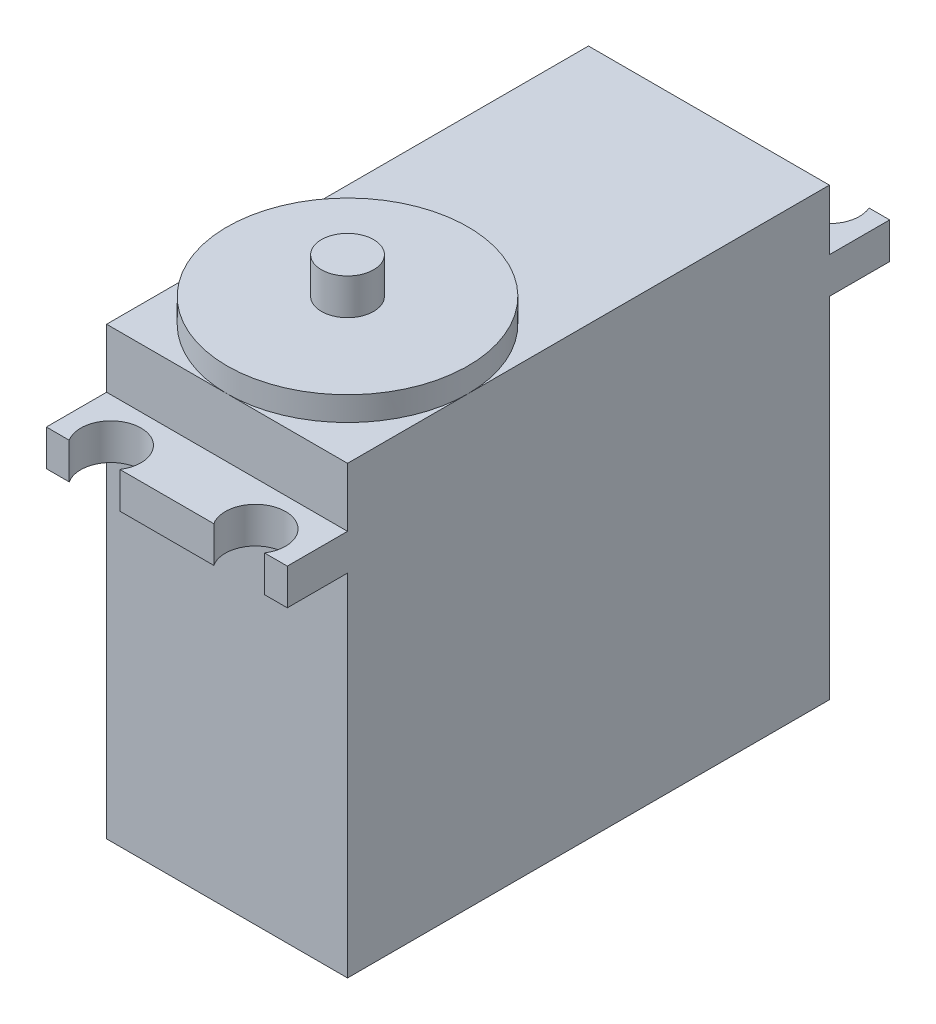
ISO-10303-21;
HEADER;
FILE_DESCRIPTION(('STEP AP214'),'2;1');
FILE_NAME('part.step','',(''),(''),'','','');
FILE_SCHEMA(('AUTOMOTIVE_DESIGN { 1 0 10303 214 1 1 1 1 }'));
ENDSEC;
DATA;
#1=APPLICATION_CONTEXT('core data for automotive mechanical design processes');
#2=APPLICATION_PROTOCOL_DEFINITION('international standard','automotive_design',2000,#1);
#3=PRODUCT_CONTEXT('',#1,'mechanical');
#4=PRODUCT('Part','Part','',(#3));
#5=PRODUCT_RELATED_PRODUCT_CATEGORY('part','',(#4));
#6=PRODUCT_DEFINITION_FORMATION('','',#4);
#7=PRODUCT_DEFINITION_CONTEXT('part definition',#1,'design');
#8=PRODUCT_DEFINITION('design','',#6,#7);
#9=PRODUCT_DEFINITION_SHAPE('','',#8);
#10=(LENGTH_UNIT() NAMED_UNIT(*) SI_UNIT(.MILLI.,.METRE.));
#11=(NAMED_UNIT(*) PLANE_ANGLE_UNIT() SI_UNIT($,.RADIAN.));
#12=(NAMED_UNIT(*) SI_UNIT($,.STERADIAN.) SOLID_ANGLE_UNIT());
#13=UNCERTAINTY_MEASURE_WITH_UNIT(LENGTH_MEASURE(1.E-05),#10,'distance_accuracy_value','');
#14=(GEOMETRIC_REPRESENTATION_CONTEXT(3) GLOBAL_UNCERTAINTY_ASSIGNED_CONTEXT((#13)) GLOBAL_UNIT_ASSIGNED_CONTEXT((#10,
#11,#12)) REPRESENTATION_CONTEXT('',''));
#15=CARTESIAN_POINT('',(0.,0.,0.));
#16=DIRECTION('',(0.,0.,1.));
#17=DIRECTION('',(1.,0.,0.));
#18=AXIS2_PLACEMENT_3D('',#15,#16,#17);
#19=CARTESIAN_POINT('',(0.,0.,-25.));
#20=DIRECTION('',(0.,0.,-1.));
#21=DIRECTION('',(-1.,0.,0.));
#22=AXIS2_PLACEMENT_3D('',#19,#20,#21);
#23=PLANE('',#22);
#24=DIRECTION('',(0.,1.,0.));
#25=VECTOR('',#24,1.);
#26=CARTESIAN_POINT('',(-8.29128784747792,29.,-25.));
#27=LINE('',#26,#25);
#28=CARTESIAN_POINT('',(-8.29128784747792,29.,-25.));
#29=VERTEX_POINT('',#28);
#30=CARTESIAN_POINT('',(-8.29128784747792,32.,-25.));
#31=VERTEX_POINT('',#30);
#32=EDGE_CURVE('E11',#29,#31,#27,.T.);
#33=ORIENTED_EDGE('',*,*,#32,.F.);
#34=DIRECTION('',(-1.,0.,0.));
#35=VECTOR('',#34,1.);
#36=CARTESIAN_POINT('',(10.,29.,-25.));
#37=LINE('',#36,#35);
#38=CARTESIAN_POINT('',(-10.,29.,-25.));
#39=VERTEX_POINT('',#38);
#40=EDGE_CURVE('E417',#29,#39,#37,.T.);
#41=ORIENTED_EDGE('',*,*,#40,.T.);
#42=DIRECTION('',(0.,1.,0.));
#43=VECTOR('',#42,1.);
#44=CARTESIAN_POINT('',(-10.,32.,-25.));
#45=LINE('',#44,#43);
#46=CARTESIAN_POINT('',(-10.,32.,-25.));
#47=VERTEX_POINT('',#46);
#48=EDGE_CURVE('E211',#39,#47,#45,.T.);
#49=ORIENTED_EDGE('',*,*,#48,.T.);
#50=DIRECTION('',(1.,0.,0.));
#51=VECTOR('',#50,1.);
#52=CARTESIAN_POINT('',(10.,32.,-25.));
#53=LINE('',#52,#51);
#54=EDGE_CURVE('E205',#47,#31,#53,.T.);
#55=ORIENTED_EDGE('',*,*,#54,.T.);
#56=EDGE_LOOP('',(#33,#41,#49,#55));
#57=FACE_BOUND('',#56,.T.);
#58=ADVANCED_FACE('F39',(#57),#23,.T.);
#59=DIRECTION('',(0.,1.,0.));
#60=VECTOR('',#59,1.);
#61=CARTESIAN_POINT('',(-3.70871215252208,29.,-25.));
#62=LINE('',#61,#60);
#63=CARTESIAN_POINT('',(-3.70871215252208,32.,-25.));
#64=VERTEX_POINT('',#63);
#65=CARTESIAN_POINT('',(-3.70871215252208,29.,-25.));
#66=VERTEX_POINT('',#65);
#67=EDGE_CURVE('E48',#64,#66,#62,.F.);
#68=ORIENTED_EDGE('',*,*,#67,.F.);
#69=CARTESIAN_POINT('',(3.70871215252208,32.,-25.));
#70=VERTEX_POINT('',#69);
#71=EDGE_CURVE('E198',#64,#70,#53,.T.);
#72=ORIENTED_EDGE('',*,*,#71,.T.);
#73=DIRECTION('',(0.,1.,0.));
#74=VECTOR('',#73,1.);
#75=CARTESIAN_POINT('',(3.70871215252208,29.,-25.));
#76=LINE('',#75,#74);
#77=CARTESIAN_POINT('',(3.70871215252208,29.,-25.));
#78=VERTEX_POINT('',#77);
#79=EDGE_CURVE('E183',#78,#70,#76,.T.);
#80=ORIENTED_EDGE('',*,*,#79,.F.);
#81=EDGE_CURVE('E415',#78,#66,#37,.T.);
#82=ORIENTED_EDGE('',*,*,#81,.T.);
#83=EDGE_LOOP('',(#68,#72,#80,#82));
#84=FACE_BOUND('',#83,.T.);
#85=ADVANCED_FACE('F203',(#84),#23,.T.);
#86=CARTESIAN_POINT('',(-10.,37.,-20.));
#87=DIRECTION('',(0.,0.,1.));
#88=DIRECTION('',(1.,0.,0.));
#89=AXIS2_PLACEMENT_3D('',#86,#87,#88);
#90=PLANE('',#89);
#91=DIRECTION('',(1.,0.,0.));
#92=VECTOR('',#91,1.);
#93=CARTESIAN_POINT('',(10.,32.,-20.));
#94=LINE('',#93,#92);
#95=CARTESIAN_POINT('',(-10.,32.,-20.));
#96=VERTEX_POINT('',#95);
#97=CARTESIAN_POINT('',(10.,32.,-20.));
#98=VERTEX_POINT('',#97);
#99=EDGE_CURVE('E219',#96,#98,#94,.T.);
#100=ORIENTED_EDGE('',*,*,#99,.F.);
#101=DIRECTION('',(0.,-1.,0.));
#102=VECTOR('',#101,1.);
#103=CARTESIAN_POINT('',(-10.,37.,-20.));
#104=LINE('',#103,#102);
#105=CARTESIAN_POINT('',(-10.,37.,-20.));
#106=VERTEX_POINT('',#105);
#107=EDGE_CURVE('E378',#106,#96,#104,.T.);
#108=ORIENTED_EDGE('',*,*,#107,.F.);
#109=DIRECTION('',(-1.,0.,0.));
#110=VECTOR('',#109,1.);
#111=CARTESIAN_POINT('',(-10.,37.,-20.));
#112=LINE('',#111,#110);
#113=CARTESIAN_POINT('',(10.,37.,-20.));
#114=VERTEX_POINT('',#113);
#115=EDGE_CURVE('E359',#114,#106,#112,.T.);
#116=ORIENTED_EDGE('',*,*,#115,.F.);
#117=DIRECTION('',(0.,-1.,0.));
#118=VECTOR('',#117,1.);
#119=CARTESIAN_POINT('',(10.,37.,-20.));
#120=LINE('',#119,#118);
#121=EDGE_CURVE('E383',#114,#98,#120,.T.);
#122=ORIENTED_EDGE('',*,*,#121,.T.);
#123=EDGE_LOOP('',(#100,#108,#116,#122));
#124=FACE_BOUND('',#123,.T.);
#125=ADVANCED_FACE('F452',(#124),#90,.F.);
#126=DIRECTION('',(-1.,0.,0.));
#127=VECTOR('',#126,1.);
#128=CARTESIAN_POINT('',(10.,29.,-20.));
#129=LINE('',#128,#127);
#130=CARTESIAN_POINT('',(10.,29.,-20.));
#131=VERTEX_POINT('',#130);
#132=CARTESIAN_POINT('',(-10.,29.,-20.));
#133=VERTEX_POINT('',#132);
#134=EDGE_CURVE('E215',#131,#133,#129,.T.);
#135=ORIENTED_EDGE('',*,*,#134,.F.);
#136=CARTESIAN_POINT('',(10.,0.,-20.));
#137=VERTEX_POINT('',#136);
#138=EDGE_CURVE('E382',#131,#137,#120,.T.);
#139=ORIENTED_EDGE('',*,*,#138,.T.);
#140=DIRECTION('',(-1.,0.,0.));
#141=VECTOR('',#140,1.);
#142=CARTESIAN_POINT('',(-10.,0.,-20.));
#143=LINE('',#142,#141);
#144=CARTESIAN_POINT('',(-10.,0.,-20.));
#145=VERTEX_POINT('',#144);
#146=EDGE_CURVE('E374',#137,#145,#143,.T.);
#147=ORIENTED_EDGE('',*,*,#146,.T.);
#148=EDGE_CURVE('E362',#133,#145,#104,.T.);
#149=ORIENTED_EDGE('',*,*,#148,.F.);
#150=EDGE_LOOP('',(#135,#139,#147,#149));
#151=FACE_BOUND('',#150,.T.);
#152=ADVANCED_FACE('F509',(#151),#90,.F.);
#153=CARTESIAN_POINT('',(0.,0.,25.));
#154=DIRECTION('',(0.,0.,1.));
#155=DIRECTION('',(1.,0.,0.));
#156=AXIS2_PLACEMENT_3D('',#153,#154,#155);
#157=PLANE('',#156);
#158=DIRECTION('',(0.,1.,0.));
#159=VECTOR('',#158,1.);
#160=CARTESIAN_POINT('',(-3.89960686421983,29.1103546903995,25.));
#161=LINE('',#160,#159);
#162=CARTESIAN_POINT('',(-3.89960686421983,29.1103546903995,25.));
#163=VERTEX_POINT('',#162);
#164=CARTESIAN_POINT('',(-3.89960686421983,32.1103546903995,25.));
#165=VERTEX_POINT('',#164);
#166=EDGE_CURVE('E404',#163,#165,#161,.T.);
#167=ORIENTED_EDGE('',*,*,#166,.F.);
#168=DIRECTION('',(1.,0.,0.));
#169=VECTOR('',#168,1.);
#170=CARTESIAN_POINT('',(-10.,29.1103546903995,25.));
#171=LINE('',#170,#169);
#172=CARTESIAN_POINT('',(3.89960686421983,29.1103546903995,25.));
#173=VERTEX_POINT('',#172);
#174=EDGE_CURVE('E266',#163,#173,#171,.T.);
#175=ORIENTED_EDGE('',*,*,#174,.T.);
#176=DIRECTION('',(0.,1.,0.));
#177=VECTOR('',#176,1.);
#178=CARTESIAN_POINT('',(3.89960686421983,29.1103546903995,25.));
#179=LINE('',#178,#177);
#180=CARTESIAN_POINT('',(3.89960686421983,32.1103546903995,25.));
#181=VERTEX_POINT('',#180);
#182=EDGE_CURVE('E302',#181,#173,#179,.F.);
#183=ORIENTED_EDGE('',*,*,#182,.F.);
#184=DIRECTION('',(-1.,0.,0.));
#185=VECTOR('',#184,1.);
#186=CARTESIAN_POINT('',(-10.,32.1103546903995,25.));
#187=LINE('',#186,#185);
#188=EDGE_CURVE('E275',#181,#165,#187,.T.);
#189=ORIENTED_EDGE('',*,*,#188,.T.);
#190=EDGE_LOOP('',(#167,#175,#183,#189));
#191=FACE_BOUND('',#190,.T.);
#192=ADVANCED_FACE('F492',(#191),#157,.T.);
#193=DIRECTION('',(0.,1.,0.));
#194=VECTOR('',#193,1.);
#195=CARTESIAN_POINT('',(8.10039313578017,29.1103546903995,25.));
#196=LINE('',#195,#194);
#197=CARTESIAN_POINT('',(8.10039313578017,29.1103546903995,25.));
#198=VERTEX_POINT('',#197);
#199=CARTESIAN_POINT('',(8.10039313578017,32.1103546903995,25.));
#200=VERTEX_POINT('',#199);
#201=EDGE_CURVE('E398',#198,#200,#196,.T.);
#202=ORIENTED_EDGE('',*,*,#201,.F.);
#203=CARTESIAN_POINT('',(10.,29.1103546903995,25.));
#204=VERTEX_POINT('',#203);
#205=EDGE_CURVE('E259',#198,#204,#171,.T.);
#206=ORIENTED_EDGE('',*,*,#205,.T.);
#207=DIRECTION('',(0.,1.,0.));
#208=VECTOR('',#207,1.);
#209=CARTESIAN_POINT('',(10.,32.1103546903995,25.));
#210=LINE('',#209,#208);
#211=CARTESIAN_POINT('',(10.,32.1103546903995,25.));
#212=VERTEX_POINT('',#211);
#213=EDGE_CURVE('E265',#204,#212,#210,.T.);
#214=ORIENTED_EDGE('',*,*,#213,.T.);
#215=EDGE_CURVE('E270',#212,#200,#187,.T.);
#216=ORIENTED_EDGE('',*,*,#215,.T.);
#217=EDGE_LOOP('',(#202,#206,#214,#216));
#218=FACE_BOUND('',#217,.T.);
#219=ADVANCED_FACE('F470',(#218),#157,.T.);
#220=CARTESIAN_POINT('',(-10.,37.,20.));
#221=DIRECTION('',(0.,0.,-1.));
#222=DIRECTION('',(-1.,0.,0.));
#223=AXIS2_PLACEMENT_3D('',#220,#221,#222);
#224=PLANE('',#223);
#225=DIRECTION('',(1.,0.,0.));
#226=VECTOR('',#225,1.);
#227=CARTESIAN_POINT('',(-10.,29.1103546903995,20.));
#228=LINE('',#227,#226);
#229=CARTESIAN_POINT('',(-10.,29.1103546903995,20.));
#230=VERTEX_POINT('',#229);
#231=CARTESIAN_POINT('',(10.,29.1103546903995,20.));
#232=VERTEX_POINT('',#231);
#233=EDGE_CURVE('E245',#230,#232,#228,.T.);
#234=ORIENTED_EDGE('',*,*,#233,.F.);
#235=DIRECTION('',(0.,-1.,0.));
#236=VECTOR('',#235,1.);
#237=CARTESIAN_POINT('',(-10.,37.,20.));
#238=LINE('',#237,#236);
#239=CARTESIAN_POINT('',(-10.,0.,20.));
#240=VERTEX_POINT('',#239);
#241=EDGE_CURVE('E391',#230,#240,#238,.T.);
#242=ORIENTED_EDGE('',*,*,#241,.T.);
#243=DIRECTION('',(1.,0.,0.));
#244=VECTOR('',#243,1.);
#245=CARTESIAN_POINT('',(-10.,0.,20.));
#246=LINE('',#245,#244);
#247=CARTESIAN_POINT('',(10.,0.,20.));
#248=VERTEX_POINT('',#247);
#249=EDGE_CURVE('E366',#240,#248,#246,.T.);
#250=ORIENTED_EDGE('',*,*,#249,.T.);
#251=DIRECTION('',(0.,-1.,0.));
#252=VECTOR('',#251,1.);
#253=CARTESIAN_POINT('',(10.,37.,20.));
#254=LINE('',#253,#252);
#255=EDGE_CURVE('E386',#232,#248,#254,.T.);
#256=ORIENTED_EDGE('',*,*,#255,.F.);
#257=EDGE_LOOP('',(#234,#242,#250,#256));
#258=FACE_BOUND('',#257,.T.);
#259=ADVANCED_FACE('F502',(#258),#224,.F.);
#260=DIRECTION('',(-1.,0.,0.));
#261=VECTOR('',#260,1.);
#262=CARTESIAN_POINT('',(-10.,32.1103546903995,20.));
#263=LINE('',#262,#261);
#264=CARTESIAN_POINT('',(10.,32.1103546903995,20.));
#265=VERTEX_POINT('',#264);
#266=CARTESIAN_POINT('',(-10.,32.1103546903995,20.));
#267=VERTEX_POINT('',#266);
#268=EDGE_CURVE('E260',#265,#267,#263,.T.);
#269=ORIENTED_EDGE('',*,*,#268,.F.);
#270=CARTESIAN_POINT('',(10.,37.,20.));
#271=VERTEX_POINT('',#270);
#272=EDGE_CURVE('E387',#271,#265,#254,.T.);
#273=ORIENTED_EDGE('',*,*,#272,.F.);
#274=DIRECTION('',(1.,0.,0.));
#275=VECTOR('',#274,1.);
#276=CARTESIAN_POINT('',(-10.,37.,20.));
#277=LINE('',#276,#275);
#278=CARTESIAN_POINT('',(0.,37.,20.));
#279=VERTEX_POINT('',#278);
#280=EDGE_CURVE('E349',#279,#271,#277,.T.);
#281=ORIENTED_EDGE('',*,*,#280,.F.);
#282=CARTESIAN_POINT('',(-10.,37.,20.));
#283=VERTEX_POINT('',#282);
#284=EDGE_CURVE('E351',#283,#279,#277,.T.);
#285=ORIENTED_EDGE('',*,*,#284,.F.);
#286=EDGE_CURVE('E392',#283,#267,#238,.T.);
#287=ORIENTED_EDGE('',*,*,#286,.T.);
#288=EDGE_LOOP('',(#269,#273,#281,#285,#287));
#289=FACE_BOUND('',#288,.T.);
#290=ADVANCED_FACE('F747',(#289),#224,.F.);
#291=CARTESIAN_POINT('',(0.,37.,0.));
#292=DIRECTION('',(0.,1.,0.));
#293=DIRECTION('',(0.,0.,1.));
#294=AXIS2_PLACEMENT_3D('',#291,#292,#293);
#295=PLANE('',#294);
#296=CARTESIAN_POINT('',(0.,37.,10.));
#297=DIRECTION('',(0.,1.,0.));
#298=DIRECTION('',(0.,0.,1.));
#299=AXIS2_PLACEMENT_3D('',#296,#297,#298);
#300=CIRCLE('',#299,10.);
#301=CARTESIAN_POINT('',(10.,37.,10.));
#302=VERTEX_POINT('',#301);
#303=EDGE_CURVE('E297',#279,#302,#300,.T.);
#304=ORIENTED_EDGE('',*,*,#303,.F.);
#305=ORIENTED_EDGE('',*,*,#280,.T.);
#306=DIRECTION('',(0.,0.,-1.));
#307=VECTOR('',#306,1.);
#308=CARTESIAN_POINT('',(10.,37.,-20.));
#309=LINE('',#308,#307);
#310=EDGE_CURVE('E355',#271,#302,#309,.T.);
#311=ORIENTED_EDGE('',*,*,#310,.T.);
#312=EDGE_LOOP('',(#304,#305,#311));
#313=FACE_BOUND('',#312,.T.);
#314=ADVANCED_FACE('F528',(#313),#295,.T.);
#315=CARTESIAN_POINT('',(-10.,37.,10.));
#316=VERTEX_POINT('',#315);
#317=EDGE_CURVE('E303',#302,#316,#300,.T.);
#318=ORIENTED_EDGE('',*,*,#317,.F.);
#319=EDGE_CURVE('E354',#302,#114,#309,.T.);
#320=ORIENTED_EDGE('',*,*,#319,.T.);
#321=ORIENTED_EDGE('',*,*,#115,.T.);
#322=DIRECTION('',(0.,0.,1.));
#323=VECTOR('',#322,1.);
#324=CARTESIAN_POINT('',(-10.,37.,-20.));
#325=LINE('',#324,#323);
#326=EDGE_CURVE('E345',#106,#316,#325,.T.);
#327=ORIENTED_EDGE('',*,*,#326,.T.);
#328=EDGE_LOOP('',(#318,#320,#321,#327));
#329=FACE_BOUND('',#328,.T.);
#330=ADVANCED_FACE('F455',(#329),#295,.T.);
#331=CARTESIAN_POINT('',(-10.,37.,-20.));
#332=DIRECTION('',(1.,0.,0.));
#333=DIRECTION('',(0.,0.,-1.));
#334=AXIS2_PLACEMENT_3D('',#331,#332,#333);
#335=PLANE('',#334);
#336=DIRECTION('',(0.,0.,1.));
#337=VECTOR('',#336,1.);
#338=CARTESIAN_POINT('',(-10.,0.,-20.));
#339=LINE('',#338,#337);
#340=EDGE_CURVE('E341',#145,#240,#339,.T.);
#341=ORIENTED_EDGE('',*,*,#340,.T.);
#342=ORIENTED_EDGE('',*,*,#241,.F.);
#343=DIRECTION('',(0.,0.,-1.));
#344=VECTOR('',#343,1.);
#345=CARTESIAN_POINT('',(-10.,29.1103546903995,25.));
#346=LINE('',#345,#344);
#347=CARTESIAN_POINT('',(-10.,29.1103546903995,25.));
#348=VERTEX_POINT('',#347);
#349=EDGE_CURVE('E290',#348,#230,#346,.T.);
#350=ORIENTED_EDGE('',*,*,#349,.F.);
#351=DIRECTION('',(0.,-1.,0.));
#352=VECTOR('',#351,1.);
#353=CARTESIAN_POINT('',(-10.,32.1103546903995,25.));
#354=LINE('',#353,#352);
#355=CARTESIAN_POINT('',(-10.,32.1103546903995,25.));
#356=VERTEX_POINT('',#355);
#357=EDGE_CURVE('E255',#356,#348,#354,.T.);
#358=ORIENTED_EDGE('',*,*,#357,.F.);
#359=DIRECTION('',(0.,0.,-1.));
#360=VECTOR('',#359,1.);
#361=CARTESIAN_POINT('',(-10.,32.1103546903995,25.));
#362=LINE('',#361,#360);
#363=EDGE_CURVE('E274',#356,#267,#362,.T.);
#364=ORIENTED_EDGE('',*,*,#363,.T.);
#365=ORIENTED_EDGE('',*,*,#286,.F.);
#366=EDGE_CURVE('E350',#316,#283,#325,.T.);
#367=ORIENTED_EDGE('',*,*,#366,.F.);
#368=ORIENTED_EDGE('',*,*,#326,.F.);
#369=ORIENTED_EDGE('',*,*,#107,.T.);
#370=DIRECTION('',(0.,0.,1.));
#371=VECTOR('',#370,1.);
#372=CARTESIAN_POINT('',(-10.,32.,-25.));
#373=LINE('',#372,#371);
#374=EDGE_CURVE('E228',#47,#96,#373,.T.);
#375=ORIENTED_EDGE('',*,*,#374,.F.);
#376=ORIENTED_EDGE('',*,*,#48,.F.);
#377=DIRECTION('',(0.,0.,1.));
#378=VECTOR('',#377,1.);
#379=CARTESIAN_POINT('',(-10.,29.,-25.));
#380=LINE('',#379,#378);
#381=EDGE_CURVE('E232',#39,#133,#380,.T.);
#382=ORIENTED_EDGE('',*,*,#381,.T.);
#383=ORIENTED_EDGE('',*,*,#148,.T.);
#384=EDGE_LOOP('',(#341,#342,#350,#358,#364,#365,#367,#368,#369,#375,#376,#382,#383));
#385=FACE_BOUND('',#384,.T.);
#386=ADVANCED_FACE('F41',(#385),#335,.F.);
#387=CARTESIAN_POINT('',(10.,37.,-20.));
#388=DIRECTION('',(-1.,0.,0.));
#389=DIRECTION('',(0.,0.,1.));
#390=AXIS2_PLACEMENT_3D('',#387,#388,#389);
#391=PLANE('',#390);
#392=DIRECTION('',(0.,0.,-1.));
#393=VECTOR('',#392,1.);
#394=CARTESIAN_POINT('',(10.,0.,-20.));
#395=LINE('',#394,#393);
#396=EDGE_CURVE('E370',#248,#137,#395,.T.);
#397=ORIENTED_EDGE('',*,*,#396,.T.);
#398=ORIENTED_EDGE('',*,*,#138,.F.);
#399=DIRECTION('',(0.,0.,1.));
#400=VECTOR('',#399,1.);
#401=CARTESIAN_POINT('',(10.,29.,-25.));
#402=LINE('',#401,#400);
#403=CARTESIAN_POINT('',(10.,29.,-25.));
#404=VERTEX_POINT('',#403);
#405=EDGE_CURVE('E236',#404,#131,#402,.T.);
#406=ORIENTED_EDGE('',*,*,#405,.F.);
#407=DIRECTION('',(0.,-1.,0.));
#408=VECTOR('',#407,1.);
#409=CARTESIAN_POINT('',(10.,32.,-25.));
#410=LINE('',#409,#408);
#411=CARTESIAN_POINT('',(10.,32.,-25.));
#412=VERTEX_POINT('',#411);
#413=EDGE_CURVE('E224',#412,#404,#410,.T.);
#414=ORIENTED_EDGE('',*,*,#413,.F.);
#415=DIRECTION('',(0.,0.,1.));
#416=VECTOR('',#415,1.);
#417=CARTESIAN_POINT('',(10.,32.,-25.));
#418=LINE('',#417,#416);
#419=EDGE_CURVE('E210',#412,#98,#418,.T.);
#420=ORIENTED_EDGE('',*,*,#419,.T.);
#421=ORIENTED_EDGE('',*,*,#121,.F.);
#422=ORIENTED_EDGE('',*,*,#319,.F.);
#423=ORIENTED_EDGE('',*,*,#310,.F.);
#424=ORIENTED_EDGE('',*,*,#272,.T.);
#425=DIRECTION('',(0.,0.,-1.));
#426=VECTOR('',#425,1.);
#427=CARTESIAN_POINT('',(10.,32.1103546903995,25.));
#428=LINE('',#427,#426);
#429=EDGE_CURVE('E284',#212,#265,#428,.T.);
#430=ORIENTED_EDGE('',*,*,#429,.F.);
#431=ORIENTED_EDGE('',*,*,#213,.F.);
#432=DIRECTION('',(0.,0.,-1.));
#433=VECTOR('',#432,1.);
#434=CARTESIAN_POINT('',(10.,29.1103546903995,25.));
#435=LINE('',#434,#433);
#436=EDGE_CURVE('E287',#204,#232,#435,.T.);
#437=ORIENTED_EDGE('',*,*,#436,.T.);
#438=ORIENTED_EDGE('',*,*,#255,.T.);
#439=EDGE_LOOP('',(#397,#398,#406,#414,#420,#421,#422,#423,#424,#430,#431,#437,#438));
#440=FACE_BOUND('',#439,.T.);
#441=ADVANCED_FACE('F438',(#440),#391,.F.);
#442=EDGE_CURVE('E312',#316,#279,#300,.T.);
#443=ORIENTED_EDGE('',*,*,#442,.F.);
#444=ORIENTED_EDGE('',*,*,#366,.T.);
#445=ORIENTED_EDGE('',*,*,#284,.T.);
#446=EDGE_LOOP('',(#443,#444,#445));
#447=FACE_BOUND('',#446,.T.);
#448=ADVANCED_FACE('F516',(#447),#295,.T.);
#449=CARTESIAN_POINT('',(0.,0.,0.));
#450=DIRECTION('',(0.,1.,0.));
#451=DIRECTION('',(0.,0.,1.));
#452=AXIS2_PLACEMENT_3D('',#449,#450,#451);
#453=PLANE('',#452);
#454=CARTESIAN_POINT('',(9.00000000000001,0.,-19.));
#455=DIRECTION('',(0.,1.,0.));
#456=DIRECTION('',(0.,0.,1.));
#457=AXIS2_PLACEMENT_3D('',#454,#455,#456);
#458=CIRCLE('',#457,0.75);
#459=CARTESIAN_POINT('',(9.00000000000001,0.,-18.25));
#460=VERTEX_POINT('',#459);
#461=EDGE_CURVE('E326',#460,#460,#458,.T.);
#462=ORIENTED_EDGE('',*,*,#461,.T.);
#463=EDGE_LOOP('',(#462));
#464=FACE_BOUND('',#463,.T.);
#465=CARTESIAN_POINT('',(-9.,0.,19.));
#466=DIRECTION('',(0.,1.,0.));
#467=DIRECTION('',(0.,0.,1.));
#468=AXIS2_PLACEMENT_3D('',#465,#466,#467);
#469=CIRCLE('',#468,0.75);
#470=CARTESIAN_POINT('',(-9.,0.,19.75));
#471=VERTEX_POINT('',#470);
#472=EDGE_CURVE('E317',#471,#471,#469,.T.);
#473=ORIENTED_EDGE('',*,*,#472,.T.);
#474=EDGE_LOOP('',(#473));
#475=FACE_BOUND('',#474,.T.);
#476=CARTESIAN_POINT('',(9.00000000000001,0.,19.));
#477=DIRECTION('',(0.,1.,0.));
#478=DIRECTION('',(0.,0.,1.));
#479=AXIS2_PLACEMENT_3D('',#476,#477,#478);
#480=CIRCLE('',#479,0.75);
#481=CARTESIAN_POINT('',(9.00000000000001,0.,19.75));
#482=VERTEX_POINT('',#481);
#483=EDGE_CURVE('E308',#482,#482,#480,.T.);
#484=ORIENTED_EDGE('',*,*,#483,.T.);
#485=EDGE_LOOP('',(#484));
#486=FACE_BOUND('',#485,.T.);
#487=CARTESIAN_POINT('',(-9.,0.,-19.));
#488=DIRECTION('',(0.,1.,0.));
#489=DIRECTION('',(0.,0.,1.));
#490=AXIS2_PLACEMENT_3D('',#487,#488,#489);
#491=CIRCLE('',#490,0.75);
#492=CARTESIAN_POINT('',(-9.,0.,-18.25));
#493=VERTEX_POINT('',#492);
#494=EDGE_CURVE('E325',#493,#493,#491,.T.);
#495=ORIENTED_EDGE('',*,*,#494,.T.);
#496=EDGE_LOOP('',(#495));
#497=FACE_BOUND('',#496,.T.);
#498=ORIENTED_EDGE('',*,*,#340,.F.);
#499=ORIENTED_EDGE('',*,*,#146,.F.);
#500=ORIENTED_EDGE('',*,*,#396,.F.);
#501=ORIENTED_EDGE('',*,*,#249,.F.);
#502=EDGE_LOOP('',(#498,#499,#500,#501));
#503=FACE_BOUND('',#502,.T.);
#504=ADVANCED_FACE('F513',(#464,#475,#486,#497,#503),#453,.F.);
#505=CARTESIAN_POINT('',(-9.,2.,-19.));
#506=DIRECTION('',(0.,-1.,0.));
#507=DIRECTION('',(0.,0.,-1.));
#508=AXIS2_PLACEMENT_3D('',#505,#506,#507);
#509=CYLINDRICAL_SURFACE('',#508,0.75);
#510=CARTESIAN_POINT('',(-9.,2.,-19.));
#511=DIRECTION('',(0.,1.,0.));
#512=DIRECTION('',(0.,0.,1.));
#513=AXIS2_PLACEMENT_3D('',#510,#511,#512);
#514=CIRCLE('',#513,0.75);
#515=CARTESIAN_POINT('',(-9.,2.,-18.25));
#516=VERTEX_POINT('',#515);
#517=EDGE_CURVE('E337',#516,#516,#514,.T.);
#518=ORIENTED_EDGE('',*,*,#517,.T.);
#519=EDGE_LOOP('',(#518));
#520=FACE_BOUND('',#519,.T.);
#521=ORIENTED_EDGE('',*,*,#494,.F.);
#522=EDGE_LOOP('',(#521));
#523=FACE_BOUND('',#522,.T.);
#524=ADVANCED_FACE('F515',(#520,#523),#509,.F.);
#525=CARTESIAN_POINT('',(-9.,2.,-19.));
#526=DIRECTION('',(0.,1.,0.));
#527=DIRECTION('',(0.,0.,1.));
#528=AXIS2_PLACEMENT_3D('',#525,#526,#527);
#529=PLANE('',#528);
#530=ORIENTED_EDGE('',*,*,#517,.F.);
#531=EDGE_LOOP('',(#530));
#532=FACE_BOUND('',#531,.T.);
#533=ADVANCED_FACE('F523',(#532),#529,.F.);
#534=CARTESIAN_POINT('',(9.00000000000001,2.,19.));
#535=DIRECTION('',(0.,-1.,0.));
#536=DIRECTION('',(0.,0.,-1.));
#537=AXIS2_PLACEMENT_3D('',#534,#535,#536);
#538=CYLINDRICAL_SURFACE('',#537,0.75);
#539=CARTESIAN_POINT('',(9.00000000000001,2.,19.));
#540=DIRECTION('',(0.,1.,0.));
#541=DIRECTION('',(0.,0.,1.));
#542=AXIS2_PLACEMENT_3D('',#539,#540,#541);
#543=CIRCLE('',#542,0.75);
#544=CARTESIAN_POINT('',(9.00000000000001,2.,19.75));
#545=VERTEX_POINT('',#544);
#546=EDGE_CURVE('E313',#545,#545,#543,.T.);
#547=ORIENTED_EDGE('',*,*,#546,.T.);
#548=EDGE_LOOP('',(#547));
#549=FACE_BOUND('',#548,.T.);
#550=ORIENTED_EDGE('',*,*,#483,.F.);
#551=EDGE_LOOP('',(#550));
#552=FACE_BOUND('',#551,.T.);
#553=ADVANCED_FACE('F580',(#549,#552),#538,.F.);
#554=CARTESIAN_POINT('',(9.00000000000001,2.,19.));
#555=DIRECTION('',(0.,1.,0.));
#556=DIRECTION('',(0.,0.,1.));
#557=AXIS2_PLACEMENT_3D('',#554,#555,#556);
#558=PLANE('',#557);
#559=ORIENTED_EDGE('',*,*,#546,.F.);
#560=EDGE_LOOP('',(#559));
#561=FACE_BOUND('',#560,.T.);
#562=ADVANCED_FACE('F576',(#561),#558,.F.);
#563=CARTESIAN_POINT('',(-9.,2.,19.));
#564=DIRECTION('',(0.,-1.,0.));
#565=DIRECTION('',(0.,0.,-1.));
#566=AXIS2_PLACEMENT_3D('',#563,#564,#565);
#567=CYLINDRICAL_SURFACE('',#566,0.75);
#568=CARTESIAN_POINT('',(-9.,2.,19.));
#569=DIRECTION('',(0.,1.,0.));
#570=DIRECTION('',(0.,0.,1.));
#571=AXIS2_PLACEMENT_3D('',#568,#569,#570);
#572=CIRCLE('',#571,0.75);
#573=CARTESIAN_POINT('',(-9.,2.,19.75));
#574=VERTEX_POINT('',#573);
#575=EDGE_CURVE('E330',#574,#574,#572,.T.);
#576=ORIENTED_EDGE('',*,*,#575,.T.);
#577=EDGE_LOOP('',(#576));
#578=FACE_BOUND('',#577,.T.);
#579=ORIENTED_EDGE('',*,*,#472,.F.);
#580=EDGE_LOOP('',(#579));
#581=FACE_BOUND('',#580,.T.);
#582=ADVANCED_FACE('F579',(#578,#581),#567,.F.);
#583=CARTESIAN_POINT('',(-9.,2.,19.));
#584=DIRECTION('',(0.,1.,0.));
#585=DIRECTION('',(0.,0.,1.));
#586=AXIS2_PLACEMENT_3D('',#583,#584,#585);
#587=PLANE('',#586);
#588=ORIENTED_EDGE('',*,*,#575,.F.);
#589=EDGE_LOOP('',(#588));
#590=FACE_BOUND('',#589,.T.);
#591=ADVANCED_FACE('F591',(#590),#587,.F.);
#592=CARTESIAN_POINT('',(9.00000000000001,2.,-19.));
#593=DIRECTION('',(0.,-1.,0.));
#594=DIRECTION('',(0.,0.,-1.));
#595=AXIS2_PLACEMENT_3D('',#592,#593,#594);
#596=CYLINDRICAL_SURFACE('',#595,0.75);
#597=CARTESIAN_POINT('',(9.00000000000001,2.,-19.));
#598=DIRECTION('',(0.,1.,0.));
#599=DIRECTION('',(0.,0.,1.));
#600=AXIS2_PLACEMENT_3D('',#597,#598,#599);
#601=CIRCLE('',#600,0.75);
#602=CARTESIAN_POINT('',(9.00000000000001,2.,-18.25));
#603=VERTEX_POINT('',#602);
#604=EDGE_CURVE('E321',#603,#603,#601,.T.);
#605=ORIENTED_EDGE('',*,*,#604,.T.);
#606=EDGE_LOOP('',(#605));
#607=FACE_BOUND('',#606,.T.);
#608=ORIENTED_EDGE('',*,*,#461,.F.);
#609=EDGE_LOOP('',(#608));
#610=FACE_BOUND('',#609,.T.);
#611=ADVANCED_FACE('F587',(#607,#610),#596,.F.);
#612=CARTESIAN_POINT('',(9.00000000000001,2.,-19.));
#613=DIRECTION('',(0.,1.,0.));
#614=DIRECTION('',(0.,0.,1.));
#615=AXIS2_PLACEMENT_3D('',#612,#613,#614);
#616=PLANE('',#615);
#617=ORIENTED_EDGE('',*,*,#604,.F.);
#618=EDGE_LOOP('',(#617));
#619=FACE_BOUND('',#618,.T.);
#620=ADVANCED_FACE('F574',(#619),#616,.F.);
#621=CARTESIAN_POINT('',(0.,39.,10.));
#622=DIRECTION('',(0.,-1.,0.));
#623=DIRECTION('',(0.,0.,-1.));
#624=AXIS2_PLACEMENT_3D('',#621,#622,#623);
#625=CYLINDRICAL_SURFACE('',#624,10.);
#626=CARTESIAN_POINT('',(0.,39.,10.));
#627=DIRECTION('',(0.,1.,0.));
#628=DIRECTION('',(0.,0.,1.));
#629=AXIS2_PLACEMENT_3D('',#626,#627,#628);
#630=CIRCLE('',#629,10.);
#631=CARTESIAN_POINT('',(0.,39.,20.));
#632=VERTEX_POINT('',#631);
#633=EDGE_CURVE('E304',#632,#632,#630,.T.);
#634=ORIENTED_EDGE('',*,*,#633,.F.);
#635=EDGE_LOOP('',(#634));
#636=FACE_BOUND('',#635,.T.);
#637=ORIENTED_EDGE('',*,*,#303,.T.);
#638=ORIENTED_EDGE('',*,*,#317,.T.);
#639=ORIENTED_EDGE('',*,*,#442,.T.);
#640=EDGE_LOOP('',(#637,#638,#639));
#641=FACE_BOUND('',#640,.T.);
#642=ADVANCED_FACE('F570',(#636,#641),#625,.T.);
#643=CARTESIAN_POINT('',(0.,39.,10.));
#644=DIRECTION('',(0.,1.,0.));
#645=DIRECTION('',(0.,0.,1.));
#646=AXIS2_PLACEMENT_3D('',#643,#644,#645);
#647=PLANE('',#646);
#648=CARTESIAN_POINT('',(0.,39.,10.));
#649=DIRECTION('',(0.,1.,0.));
#650=DIRECTION('',(0.,0.,1.));
#651=AXIS2_PLACEMENT_3D('',#648,#649,#650);
#652=CIRCLE('',#651,2.16738843435683);
#653=CARTESIAN_POINT('',(0.,39.,12.1673884343568));
#654=VERTEX_POINT('',#653);
#655=EDGE_CURVE('E298',#654,#654,#652,.T.);
#656=ORIENTED_EDGE('',*,*,#655,.F.);
#657=EDGE_LOOP('',(#656));
#658=FACE_BOUND('',#657,.T.);
#659=ORIENTED_EDGE('',*,*,#633,.T.);
#660=EDGE_LOOP('',(#659));
#661=FACE_BOUND('',#660,.T.);
#662=ADVANCED_FACE('F566',(#658,#661),#647,.T.);
#663=CARTESIAN_POINT('',(0.,42.,10.));
#664=DIRECTION('',(0.,-1.,0.));
#665=DIRECTION('',(0.,0.,-1.));
#666=AXIS2_PLACEMENT_3D('',#663,#664,#665);
#667=CYLINDRICAL_SURFACE('',#666,2.16738843435683);
#668=CARTESIAN_POINT('',(0.,42.,10.));
#669=DIRECTION('',(0.,1.,0.));
#670=DIRECTION('',(0.,0.,1.));
#671=AXIS2_PLACEMENT_3D('',#668,#669,#670);
#672=CIRCLE('',#671,2.16738843435683);
#673=CARTESIAN_POINT('',(0.,42.,12.1673884343568));
#674=VERTEX_POINT('',#673);
#675=EDGE_CURVE('E293',#674,#674,#672,.T.);
#676=ORIENTED_EDGE('',*,*,#675,.F.);
#677=EDGE_LOOP('',(#676));
#678=FACE_BOUND('',#677,.T.);
#679=ORIENTED_EDGE('',*,*,#655,.T.);
#680=EDGE_LOOP('',(#679));
#681=FACE_BOUND('',#680,.T.);
#682=ADVANCED_FACE('F562',(#678,#681),#667,.T.);
#683=CARTESIAN_POINT('',(0.,42.,10.));
#684=DIRECTION('',(0.,1.,0.));
#685=DIRECTION('',(0.,0.,1.));
#686=AXIS2_PLACEMENT_3D('',#683,#684,#685);
#687=PLANE('',#686);
#688=ORIENTED_EDGE('',*,*,#675,.T.);
#689=EDGE_LOOP('',(#688));
#690=FACE_BOUND('',#689,.T.);
#691=ADVANCED_FACE('F559',(#690),#687,.T.);
#692=CARTESIAN_POINT('',(-10.,29.1103546903995,25.));
#693=DIRECTION('',(0.,1.,0.));
#694=DIRECTION('',(0.,0.,1.));
#695=AXIS2_PLACEMENT_3D('',#692,#693,#694);
#696=PLANE('',#695);
#697=ORIENTED_EDGE('',*,*,#174,.F.);
#698=CARTESIAN_POINT('',(-6.,29.1103546903995,23.6441428264129));
#699=DIRECTION('',(0.,1.,0.));
#700=DIRECTION('',(0.,0.,1.));
#701=AXIS2_PLACEMENT_3D('',#698,#699,#700);
#702=CIRCLE('',#701,2.5);
#703=CARTESIAN_POINT('',(-8.10039313578017,29.1103546903995,25.));
#704=VERTEX_POINT('',#703);
#705=EDGE_CURVE('E241',#163,#704,#702,.T.);
#706=ORIENTED_EDGE('',*,*,#705,.T.);
#707=EDGE_CURVE('E261',#348,#704,#171,.T.);
#708=ORIENTED_EDGE('',*,*,#707,.F.);
#709=ORIENTED_EDGE('',*,*,#349,.T.);
#710=ORIENTED_EDGE('',*,*,#233,.T.);
#711=ORIENTED_EDGE('',*,*,#436,.F.);
#712=ORIENTED_EDGE('',*,*,#205,.F.);
#713=CARTESIAN_POINT('',(6.,29.1103546903995,23.6441428264129));
#714=DIRECTION('',(0.,1.,0.));
#715=DIRECTION('',(0.,0.,1.));
#716=AXIS2_PLACEMENT_3D('',#713,#714,#715);
#717=CIRCLE('',#716,2.5);
#718=EDGE_CURVE('E249',#198,#173,#717,.T.);
#719=ORIENTED_EDGE('',*,*,#718,.T.);
#720=EDGE_LOOP('',(#697,#706,#708,#709,#710,#711,#712,#719));
#721=FACE_BOUND('',#720,.T.);
#722=ADVANCED_FACE('F475',(#721),#696,.F.);
#723=CARTESIAN_POINT('',(-10.,32.1103546903995,25.));
#724=DIRECTION('',(0.,-1.,0.));
#725=DIRECTION('',(0.,0.,-1.));
#726=AXIS2_PLACEMENT_3D('',#723,#724,#725);
#727=PLANE('',#726);
#728=CARTESIAN_POINT('',(-8.10039313578017,32.1103546903995,25.));
#729=VERTEX_POINT('',#728);
#730=EDGE_CURVE('E269',#729,#356,#187,.T.);
#731=ORIENTED_EDGE('',*,*,#730,.F.);
#732=CARTESIAN_POINT('',(-6.,32.1103546903995,23.6441428264129));
#733=DIRECTION('',(0.,1.,0.));
#734=DIRECTION('',(0.,0.,1.));
#735=AXIS2_PLACEMENT_3D('',#732,#733,#734);
#736=CIRCLE('',#735,2.5);
#737=EDGE_CURVE('E246',#165,#729,#736,.T.);
#738=ORIENTED_EDGE('',*,*,#737,.F.);
#739=ORIENTED_EDGE('',*,*,#188,.F.);
#740=CARTESIAN_POINT('',(6.,32.1103546903995,23.6441428264129));
#741=DIRECTION('',(0.,1.,0.));
#742=DIRECTION('',(0.,0.,1.));
#743=AXIS2_PLACEMENT_3D('',#740,#741,#742);
#744=CIRCLE('',#743,2.5);
#745=EDGE_CURVE('E240',#200,#181,#744,.T.);
#746=ORIENTED_EDGE('',*,*,#745,.F.);
#747=ORIENTED_EDGE('',*,*,#215,.F.);
#748=ORIENTED_EDGE('',*,*,#429,.T.);
#749=ORIENTED_EDGE('',*,*,#268,.T.);
#750=ORIENTED_EDGE('',*,*,#363,.F.);
#751=EDGE_LOOP('',(#731,#738,#739,#746,#747,#748,#749,#750));
#752=FACE_BOUND('',#751,.T.);
#753=ADVANCED_FACE('F484',(#752),#727,.F.);
#754=DIRECTION('',(0.,1.,0.));
#755=VECTOR('',#754,1.);
#756=CARTESIAN_POINT('',(-8.10039313578017,29.1103546903995,25.));
#757=LINE('',#756,#755);
#758=EDGE_CURVE('E401',#729,#704,#757,.F.);
#759=ORIENTED_EDGE('',*,*,#758,.F.);
#760=ORIENTED_EDGE('',*,*,#730,.T.);
#761=ORIENTED_EDGE('',*,*,#357,.T.);
#762=ORIENTED_EDGE('',*,*,#707,.T.);
#763=EDGE_LOOP('',(#759,#760,#761,#762));
#764=FACE_BOUND('',#763,.T.);
#765=ADVANCED_FACE('F496',(#764),#157,.T.);
#766=CARTESIAN_POINT('',(6.,29.1103546903995,23.6441428264129));
#767=DIRECTION('',(0.,1.,0.));
#768=DIRECTION('',(0.,0.,1.));
#769=AXIS2_PLACEMENT_3D('',#766,#767,#768);
#770=CYLINDRICAL_SURFACE('',#769,2.5);
#771=ORIENTED_EDGE('',*,*,#201,.T.);
#772=ORIENTED_EDGE('',*,*,#745,.T.);
#773=ORIENTED_EDGE('',*,*,#182,.T.);
#774=ORIENTED_EDGE('',*,*,#718,.F.);
#775=EDGE_LOOP('',(#771,#772,#773,#774));
#776=FACE_BOUND('',#775,.T.);
#777=ADVANCED_FACE('F489',(#776),#770,.F.);
#778=CARTESIAN_POINT('',(-6.,29.1103546903995,23.6441428264129));
#779=DIRECTION('',(0.,1.,0.));
#780=DIRECTION('',(0.,0.,1.));
#781=AXIS2_PLACEMENT_3D('',#778,#779,#780);
#782=CYLINDRICAL_SURFACE('',#781,2.5);
#783=ORIENTED_EDGE('',*,*,#166,.T.);
#784=ORIENTED_EDGE('',*,*,#737,.T.);
#785=ORIENTED_EDGE('',*,*,#758,.T.);
#786=ORIENTED_EDGE('',*,*,#705,.F.);
#787=EDGE_LOOP('',(#783,#784,#785,#786));
#788=FACE_BOUND('',#787,.T.);
#789=ADVANCED_FACE('F546',(#788),#782,.F.);
#790=CARTESIAN_POINT('',(10.,29.,-25.));
#791=DIRECTION('',(0.,1.,0.));
#792=DIRECTION('',(0.,0.,1.));
#793=AXIS2_PLACEMENT_3D('',#790,#791,#792);
#794=PLANE('',#793);
#795=ORIENTED_EDGE('',*,*,#40,.F.);
#796=CARTESIAN_POINT('',(-6.,29.,-24.));
#797=DIRECTION('',(0.,1.,0.));
#798=DIRECTION('',(0.,0.,1.));
#799=AXIS2_PLACEMENT_3D('',#796,#797,#798);
#800=CIRCLE('',#799,2.5);
#801=EDGE_CURVE('E220',#29,#66,#800,.T.);
#802=ORIENTED_EDGE('',*,*,#801,.T.);
#803=ORIENTED_EDGE('',*,*,#81,.F.);
#804=CARTESIAN_POINT('',(6.,29.,-24.));
#805=DIRECTION('',(0.,1.,0.));
#806=DIRECTION('',(0.,0.,1.));
#807=AXIS2_PLACEMENT_3D('',#804,#805,#806);
#808=CIRCLE('',#807,2.5);
#809=CARTESIAN_POINT('',(8.29128784747792,29.,-25.));
#810=VERTEX_POINT('',#809);
#811=EDGE_CURVE('E186',#78,#810,#808,.T.);
#812=ORIENTED_EDGE('',*,*,#811,.T.);
#813=EDGE_CURVE('E421',#404,#810,#37,.T.);
#814=ORIENTED_EDGE('',*,*,#813,.F.);
#815=ORIENTED_EDGE('',*,*,#405,.T.);
#816=ORIENTED_EDGE('',*,*,#134,.T.);
#817=ORIENTED_EDGE('',*,*,#381,.F.);
#818=EDGE_LOOP('',(#795,#802,#803,#812,#814,#815,#816,#817));
#819=FACE_BOUND('',#818,.T.);
#820=ADVANCED_FACE('F414',(#819),#794,.F.);
#821=CARTESIAN_POINT('',(10.,32.,-25.));
#822=DIRECTION('',(0.,-1.,0.));
#823=DIRECTION('',(0.,0.,-1.));
#824=AXIS2_PLACEMENT_3D('',#821,#822,#823);
#825=PLANE('',#824);
#826=ORIENTED_EDGE('',*,*,#71,.F.);
#827=CARTESIAN_POINT('',(-6.,32.,-24.));
#828=DIRECTION('',(0.,1.,0.));
#829=DIRECTION('',(0.,0.,1.));
#830=AXIS2_PLACEMENT_3D('',#827,#828,#829);
#831=CIRCLE('',#830,2.5);
#832=EDGE_CURVE('E62',#31,#64,#831,.T.);
#833=ORIENTED_EDGE('',*,*,#832,.F.);
#834=ORIENTED_EDGE('',*,*,#54,.F.);
#835=ORIENTED_EDGE('',*,*,#374,.T.);
#836=ORIENTED_EDGE('',*,*,#99,.T.);
#837=ORIENTED_EDGE('',*,*,#419,.F.);
#838=CARTESIAN_POINT('',(8.29128784747792,32.,-25.));
#839=VERTEX_POINT('',#838);
#840=EDGE_CURVE('E200',#839,#412,#53,.T.);
#841=ORIENTED_EDGE('',*,*,#840,.F.);
#842=CARTESIAN_POINT('',(6.,32.,-24.));
#843=DIRECTION('',(0.,1.,0.));
#844=DIRECTION('',(0.,0.,1.));
#845=AXIS2_PLACEMENT_3D('',#842,#843,#844);
#846=CIRCLE('',#845,2.5);
#847=EDGE_CURVE('E55',#70,#839,#846,.T.);
#848=ORIENTED_EDGE('',*,*,#847,.F.);
#849=EDGE_LOOP('',(#826,#833,#834,#835,#836,#837,#841,#848));
#850=FACE_BOUND('',#849,.T.);
#851=ADVANCED_FACE('F197',(#850),#825,.F.);
#852=DIRECTION('',(0.,1.,0.));
#853=VECTOR('',#852,1.);
#854=CARTESIAN_POINT('',(8.29128784747792,29.,-25.));
#855=LINE('',#854,#853);
#856=EDGE_CURVE('E192',#839,#810,#855,.F.);
#857=ORIENTED_EDGE('',*,*,#856,.F.);
#858=ORIENTED_EDGE('',*,*,#840,.T.);
#859=ORIENTED_EDGE('',*,*,#413,.T.);
#860=ORIENTED_EDGE('',*,*,#813,.T.);
#861=EDGE_LOOP('',(#857,#858,#859,#860));
#862=FACE_BOUND('',#861,.T.);
#863=ADVANCED_FACE('F433',(#862),#23,.T.);
#864=CARTESIAN_POINT('',(6.,29.,-24.));
#865=DIRECTION('',(0.,1.,0.));
#866=DIRECTION('',(0.,0.,1.));
#867=AXIS2_PLACEMENT_3D('',#864,#865,#866);
#868=CYLINDRICAL_SURFACE('',#867,2.5);
#869=ORIENTED_EDGE('',*,*,#79,.T.);
#870=ORIENTED_EDGE('',*,*,#847,.T.);
#871=ORIENTED_EDGE('',*,*,#856,.T.);
#872=ORIENTED_EDGE('',*,*,#811,.F.);
#873=EDGE_LOOP('',(#869,#870,#871,#872));
#874=FACE_BOUND('',#873,.T.);
#875=ADVANCED_FACE('F184',(#874),#868,.F.);
#876=CARTESIAN_POINT('',(-6.,29.,-24.));
#877=DIRECTION('',(0.,1.,0.));
#878=DIRECTION('',(0.,0.,1.));
#879=AXIS2_PLACEMENT_3D('',#876,#877,#878);
#880=CYLINDRICAL_SURFACE('',#879,2.5);
#881=ORIENTED_EDGE('',*,*,#32,.T.);
#882=ORIENTED_EDGE('',*,*,#832,.T.);
#883=ORIENTED_EDGE('',*,*,#67,.T.);
#884=ORIENTED_EDGE('',*,*,#801,.F.);
#885=EDGE_LOOP('',(#881,#882,#883,#884));
#886=FACE_BOUND('',#885,.T.);
#887=ADVANCED_FACE('F410',(#886),#880,.F.);
#888=CLOSED_SHELL('',(#58,#85,#125,#152,#192,#219,#259,#290,#314,#330,#386,#441,#448,#504,#524,
#533,#553,#562,#582,#591,#611,#620,#642,#662,#682,#691,#722,#753,#765,#777,#789,#820,#851,#863,
#875,#887));
#889=MANIFOLD_SOLID_BREP('B2',#888);
#890=ADVANCED_BREP_SHAPE_REPRESENTATION('',(#18,#889),#14);
#891=SHAPE_DEFINITION_REPRESENTATION(#9,#890);
ENDSEC;
END-ISO-10303-21;
